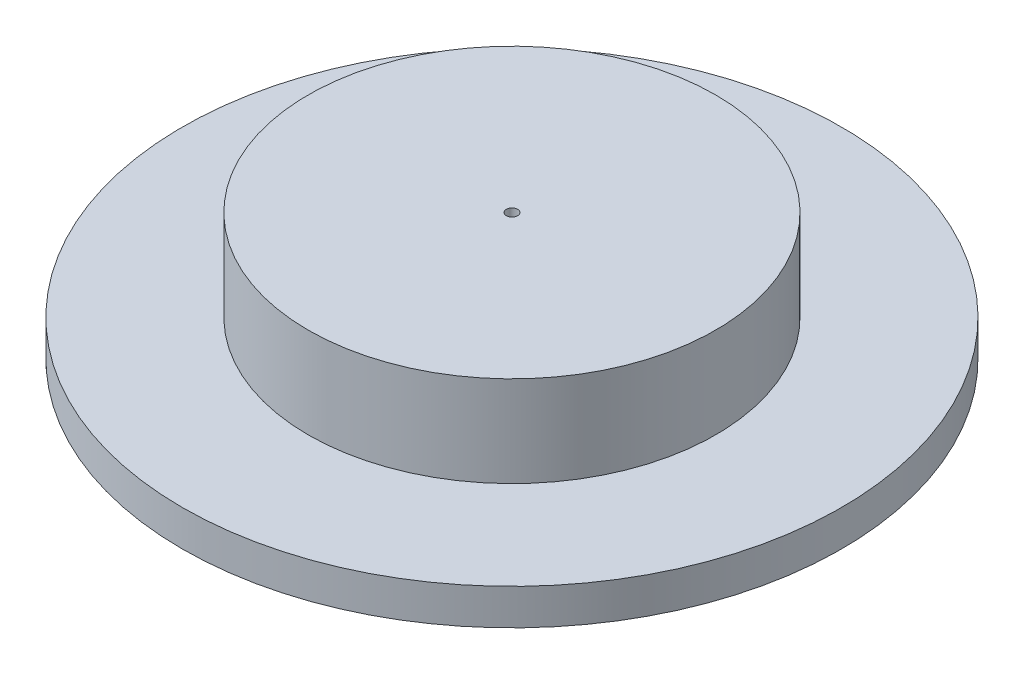
ISO-10303-21;
HEADER;
FILE_DESCRIPTION(('STEP AP214'),'2;1');
FILE_NAME('part.step','',(''),(''),'','','');
FILE_SCHEMA(('AUTOMOTIVE_DESIGN { 1 0 10303 214 1 1 1 1 }'));
ENDSEC;
DATA;
#1=APPLICATION_CONTEXT('core data for automotive mechanical design processes');
#2=APPLICATION_PROTOCOL_DEFINITION('international standard','automotive_design',2000,#1);
#3=PRODUCT_CONTEXT('',#1,'mechanical');
#4=PRODUCT('Part','Part','',(#3));
#5=PRODUCT_RELATED_PRODUCT_CATEGORY('part','',(#4));
#6=PRODUCT_DEFINITION_FORMATION('','',#4);
#7=PRODUCT_DEFINITION_CONTEXT('part definition',#1,'design');
#8=PRODUCT_DEFINITION('design','',#6,#7);
#9=PRODUCT_DEFINITION_SHAPE('','',#8);
#10=(LENGTH_UNIT() NAMED_UNIT(*) SI_UNIT(.MILLI.,.METRE.));
#11=(NAMED_UNIT(*) PLANE_ANGLE_UNIT() SI_UNIT($,.RADIAN.));
#12=(NAMED_UNIT(*) SI_UNIT($,.STERADIAN.) SOLID_ANGLE_UNIT());
#13=UNCERTAINTY_MEASURE_WITH_UNIT(LENGTH_MEASURE(1.E-05),#10,'distance_accuracy_value','');
#14=(GEOMETRIC_REPRESENTATION_CONTEXT(3) GLOBAL_UNCERTAINTY_ASSIGNED_CONTEXT((#13)) GLOBAL_UNIT_ASSIGNED_CONTEXT((#10,
#11,#12)) REPRESENTATION_CONTEXT('',''));
#15=CARTESIAN_POINT('',(0.,0.,0.));
#16=DIRECTION('',(0.,0.,1.));
#17=DIRECTION('',(1.,0.,0.));
#18=AXIS2_PLACEMENT_3D('',#15,#16,#17);
#19=CARTESIAN_POINT('',(0.,7.62,0.));
#20=DIRECTION('',(0.,-1.,0.));
#21=DIRECTION('',(0.,0.,-1.));
#22=AXIS2_PLACEMENT_3D('',#19,#20,#21);
#23=CYLINDRICAL_SURFACE('',#22,69.85);
#24=CARTESIAN_POINT('',(0.,7.62,0.));
#25=DIRECTION('',(0.,1.,0.));
#26=DIRECTION('',(0.,0.,1.));
#27=AXIS2_PLACEMENT_3D('',#24,#25,#26);
#28=CIRCLE('',#27,69.85);
#29=CARTESIAN_POINT('',(0.,7.62,69.85));
#30=VERTEX_POINT('',#29);
#31=EDGE_CURVE('E10',#30,#30,#28,.T.);
#32=ORIENTED_EDGE('',*,*,#31,.F.);
#33=EDGE_LOOP('',(#32));
#34=FACE_BOUND('',#33,.T.);
#35=CARTESIAN_POINT('',(0.,0.,0.));
#36=DIRECTION('',(0.,1.,0.));
#37=DIRECTION('',(0.,0.,1.));
#38=AXIS2_PLACEMENT_3D('',#35,#36,#37);
#39=CIRCLE('',#38,69.85);
#40=CARTESIAN_POINT('',(0.,0.,69.85));
#41=VERTEX_POINT('',#40);
#42=EDGE_CURVE('E40',#41,#41,#39,.T.);
#43=ORIENTED_EDGE('',*,*,#42,.T.);
#44=EDGE_LOOP('',(#43));
#45=FACE_BOUND('',#44,.T.);
#46=ADVANCED_FACE('F37',(#34,#45),#23,.T.);
#47=CARTESIAN_POINT('',(0.,7.62,0.));
#48=DIRECTION('',(0.,1.,0.));
#49=DIRECTION('',(0.,0.,1.));
#50=AXIS2_PLACEMENT_3D('',#47,#48,#49);
#51=PLANE('',#50);
#52=CARTESIAN_POINT('',(0.,7.62,0.));
#53=DIRECTION('',(0.,-1.,0.));
#54=DIRECTION('',(0.,0.,-1.));
#55=AXIS2_PLACEMENT_3D('',#52,#53,#54);
#56=CIRCLE('',#55,43.18);
#57=CARTESIAN_POINT('',(0.,7.62,-43.18));
#58=VERTEX_POINT('',#57);
#59=EDGE_CURVE('E47',#58,#58,#56,.T.);
#60=ORIENTED_EDGE('',*,*,#59,.T.);
#61=EDGE_LOOP('',(#60));
#62=FACE_BOUND('',#61,.T.);
#63=ORIENTED_EDGE('',*,*,#31,.T.);
#64=EDGE_LOOP('',(#63));
#65=FACE_BOUND('',#64,.T.);
#66=ADVANCED_FACE('F80',(#62,#65),#51,.T.);
#67=CARTESIAN_POINT('',(0.,0.,0.));
#68=DIRECTION('',(0.,1.,0.));
#69=DIRECTION('',(0.,0.,1.));
#70=AXIS2_PLACEMENT_3D('',#67,#68,#69);
#71=PLANE('',#70);
#72=CARTESIAN_POINT('',(0.,0.,0.));
#73=DIRECTION('',(0.,-1.,0.));
#74=DIRECTION('',(0.,0.,-1.));
#75=AXIS2_PLACEMENT_3D('',#72,#73,#74);
#76=CIRCLE('',#75,38.1);
#77=CARTESIAN_POINT('',(0.,0.,-38.1));
#78=VERTEX_POINT('',#77);
#79=EDGE_CURVE('E61',#78,#78,#76,.T.);
#80=ORIENTED_EDGE('',*,*,#79,.F.);
#81=EDGE_LOOP('',(#80));
#82=FACE_BOUND('',#81,.T.);
#83=ORIENTED_EDGE('',*,*,#42,.F.);
#84=EDGE_LOOP('',(#83));
#85=FACE_BOUND('',#84,.T.);
#86=ADVANCED_FACE('F76',(#82,#85),#71,.F.);
#87=CARTESIAN_POINT('',(0.,-0.00200000000000027,0.));
#88=DIRECTION('',(0.,1.,0.));
#89=DIRECTION('',(0.,0.,1.));
#90=AXIS2_PLACEMENT_3D('',#87,#88,#89);
#91=CYLINDRICAL_SURFACE('',#90,43.18);
#92=ORIENTED_EDGE('',*,*,#59,.F.);
#93=EDGE_LOOP('',(#92));
#94=FACE_BOUND('',#93,.T.);
#95=CARTESIAN_POINT('',(0.,26.8478,0.));
#96=DIRECTION('',(0.,1.,0.));
#97=DIRECTION('',(0.,0.,1.));
#98=AXIS2_PLACEMENT_3D('',#95,#96,#97);
#99=CIRCLE('',#98,43.18);
#100=CARTESIAN_POINT('',(0.,26.8478,43.18));
#101=VERTEX_POINT('',#100);
#102=EDGE_CURVE('E51',#101,#101,#99,.T.);
#103=ORIENTED_EDGE('',*,*,#102,.F.);
#104=EDGE_LOOP('',(#103));
#105=FACE_BOUND('',#104,.T.);
#106=ADVANCED_FACE('F79',(#94,#105),#91,.T.);
#107=CARTESIAN_POINT('',(0.,26.8478,0.));
#108=DIRECTION('',(0.,1.,0.));
#109=DIRECTION('',(0.,0.,1.));
#110=AXIS2_PLACEMENT_3D('',#107,#108,#109);
#111=PLANE('',#110);
#112=CARTESIAN_POINT('',(0.,26.8478,0.));
#113=DIRECTION('',(0.,1.,0.));
#114=DIRECTION('',(0.,0.,1.));
#115=AXIS2_PLACEMENT_3D('',#112,#113,#114);
#116=CIRCLE('',#115,1.190625);
#117=CARTESIAN_POINT('',(0.,26.8478,1.190625));
#118=VERTEX_POINT('',#117);
#119=EDGE_CURVE('E54',#118,#118,#116,.T.);
#120=ORIENTED_EDGE('',*,*,#119,.F.);
#121=EDGE_LOOP('',(#120));
#122=FACE_BOUND('',#121,.T.);
#123=ORIENTED_EDGE('',*,*,#102,.T.);
#124=EDGE_LOOP('',(#123));
#125=FACE_BOUND('',#124,.T.);
#126=ADVANCED_FACE('F95',(#122,#125),#111,.T.);
#127=CARTESIAN_POINT('',(0.,9.52499999999999,0.));
#128=DIRECTION('',(0.,1.,0.));
#129=DIRECTION('',(0.,0.,1.));
#130=AXIS2_PLACEMENT_3D('',#127,#128,#129);
#131=CYLINDRICAL_SURFACE('',#130,1.190625);
#132=CARTESIAN_POINT('',(0.,9.52499999999999,0.));
#133=DIRECTION('',(0.,1.,0.));
#134=DIRECTION('',(0.,0.,1.));
#135=AXIS2_PLACEMENT_3D('',#132,#133,#134);
#136=CIRCLE('',#135,1.190625);
#137=CARTESIAN_POINT('',(0.,9.52499999999999,1.190625));
#138=VERTEX_POINT('',#137);
#139=EDGE_CURVE('E57',#138,#138,#136,.T.);
#140=ORIENTED_EDGE('',*,*,#139,.F.);
#141=EDGE_LOOP('',(#140));
#142=FACE_BOUND('',#141,.T.);
#143=ORIENTED_EDGE('',*,*,#119,.T.);
#144=EDGE_LOOP('',(#143));
#145=FACE_BOUND('',#144,.T.);
#146=ADVANCED_FACE('F99',(#142,#145),#131,.F.);
#147=CARTESIAN_POINT('',(0.,9.525,0.));
#148=DIRECTION('',(0.,-1.,0.));
#149=DIRECTION('',(0.,0.,-1.));
#150=AXIS2_PLACEMENT_3D('',#147,#148,#149);
#151=PLANE('',#150);
#152=CARTESIAN_POINT('',(0.,9.525,0.));
#153=DIRECTION('',(0.,-1.,0.));
#154=DIRECTION('',(0.,0.,-1.));
#155=AXIS2_PLACEMENT_3D('',#152,#153,#154);
#156=CIRCLE('',#155,38.1);
#157=CARTESIAN_POINT('',(0.,9.525,-38.1));
#158=VERTEX_POINT('',#157);
#159=EDGE_CURVE('E60',#158,#158,#156,.T.);
#160=ORIENTED_EDGE('',*,*,#159,.T.);
#161=EDGE_LOOP('',(#160));
#162=FACE_BOUND('',#161,.T.);
#163=ORIENTED_EDGE('',*,*,#139,.T.);
#164=EDGE_LOOP('',(#163));
#165=FACE_BOUND('',#164,.T.);
#166=ADVANCED_FACE('F67',(#162,#165),#151,.T.);
#167=CARTESIAN_POINT('',(0.,9.525,0.));
#168=DIRECTION('',(0.,-1.,0.));
#169=DIRECTION('',(0.,0.,-1.));
#170=AXIS2_PLACEMENT_3D('',#167,#168,#169);
#171=CYLINDRICAL_SURFACE('',#170,38.1);
#172=ORIENTED_EDGE('',*,*,#159,.F.);
#173=EDGE_LOOP('',(#172));
#174=FACE_BOUND('',#173,.T.);
#175=ORIENTED_EDGE('',*,*,#79,.T.);
#176=EDGE_LOOP('',(#175));
#177=FACE_BOUND('',#176,.T.);
#178=ADVANCED_FACE('F70',(#174,#177),#171,.F.);
#179=CLOSED_SHELL('',(#46,#66,#86,#106,#126,#146,#166,#178));
#180=MANIFOLD_SOLID_BREP('B2',#179);
#181=ADVANCED_BREP_SHAPE_REPRESENTATION('',(#18,#180),#14);
#182=SHAPE_DEFINITION_REPRESENTATION(#9,#181);
ENDSEC;
END-ISO-10303-21;
